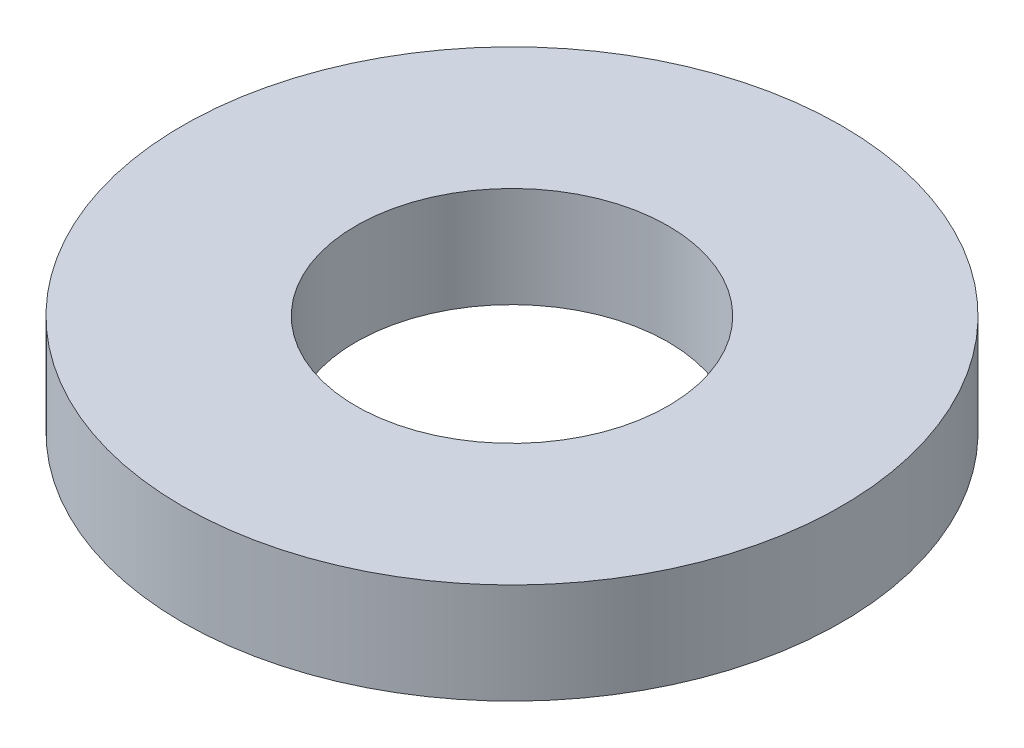
ISO-10303-21;
HEADER;
FILE_DESCRIPTION(('STEP AP214'),'2;1');
FILE_NAME('part.step','',(''),(''),'','','');
FILE_SCHEMA(('AUTOMOTIVE_DESIGN { 1 0 10303 214 1 1 1 1 }'));
ENDSEC;
DATA;
#1=APPLICATION_CONTEXT('core data for automotive mechanical design processes');
#2=APPLICATION_PROTOCOL_DEFINITION('international standard','automotive_design',2000,#1);
#3=PRODUCT_CONTEXT('',#1,'mechanical');
#4=PRODUCT('Part','Part','',(#3));
#5=PRODUCT_RELATED_PRODUCT_CATEGORY('part','',(#4));
#6=PRODUCT_DEFINITION_FORMATION('','',#4);
#7=PRODUCT_DEFINITION_CONTEXT('part definition',#1,'design');
#8=PRODUCT_DEFINITION('design','',#6,#7);
#9=PRODUCT_DEFINITION_SHAPE('','',#8);
#10=(LENGTH_UNIT() NAMED_UNIT(*) SI_UNIT(.MILLI.,.METRE.));
#11=(NAMED_UNIT(*) PLANE_ANGLE_UNIT() SI_UNIT($,.RADIAN.));
#12=(NAMED_UNIT(*) SI_UNIT($,.STERADIAN.) SOLID_ANGLE_UNIT());
#13=UNCERTAINTY_MEASURE_WITH_UNIT(LENGTH_MEASURE(1.E-05),#10,'distance_accuracy_value','');
#14=(GEOMETRIC_REPRESENTATION_CONTEXT(3) GLOBAL_UNCERTAINTY_ASSIGNED_CONTEXT((#13)) GLOBAL_UNIT_ASSIGNED_CONTEXT((#10,
#11,#12)) REPRESENTATION_CONTEXT('',''));
#15=CARTESIAN_POINT('',(0.,0.,0.));
#16=DIRECTION('',(0.,0.,1.));
#17=DIRECTION('',(1.,0.,0.));
#18=AXIS2_PLACEMENT_3D('',#15,#16,#17);
#19=CARTESIAN_POINT('',(0.,29.,0.));
#20=DIRECTION('',(0.,-1.,0.));
#21=DIRECTION('',(0.,0.,-1.));
#22=AXIS2_PLACEMENT_3D('',#19,#20,#21);
#23=CYLINDRICAL_SURFACE('',#22,95.);
#24=CARTESIAN_POINT('',(0.,29.,0.));
#25=DIRECTION('',(0.,1.,0.));
#26=DIRECTION('',(0.,0.,1.));
#27=AXIS2_PLACEMENT_3D('',#24,#25,#26);
#28=CIRCLE('',#27,95.);
#29=CARTESIAN_POINT('',(0.,29.,-95.));
#30=VERTEX_POINT('',#29);
#31=EDGE_CURVE('E10',#30,#30,#28,.T.);
#32=CARTESIAN_POINT('',(0.,0.,0.));
#33=DIRECTION('',(0.,1.,0.));
#34=DIRECTION('',(0.,0.,1.));
#35=AXIS2_PLACEMENT_3D('',#32,#33,#34);
#36=CIRCLE('',#35,95.);
#37=CARTESIAN_POINT('',(0.,0.,-95.));
#38=VERTEX_POINT('',#37);
#39=EDGE_CURVE('E37',#38,#38,#36,.T.);
#40=CARTESIAN_POINT('',(0.,29.,-95.));
#41=CARTESIAN_POINT('',(0.,28.6979166666667,-95.));
#42=CARTESIAN_POINT('',(0.,28.3958333333333,-95.));
#43=CARTESIAN_POINT('',(0.,27.7916666666667,-95.));
#44=CARTESIAN_POINT('',(0.,27.4895833333333,-95.));
#45=CARTESIAN_POINT('',(0.,26.8854166666667,-95.));
#46=CARTESIAN_POINT('',(0.,26.5833333333333,-95.));
#47=CARTESIAN_POINT('',(0.,25.9791666666667,-95.));
#48=CARTESIAN_POINT('',(0.,25.6770833333333,-95.));
#49=CARTESIAN_POINT('',(0.,25.0729166666667,-95.));
#50=CARTESIAN_POINT('',(0.,24.7708333333333,-95.));
#51=CARTESIAN_POINT('',(0.,24.1666666666667,-95.));
#52=CARTESIAN_POINT('',(0.,23.8645833333333,-95.));
#53=CARTESIAN_POINT('',(0.,23.2604166666667,-95.));
#54=CARTESIAN_POINT('',(0.,22.9583333333333,-95.));
#55=CARTESIAN_POINT('',(0.,22.3541666666667,-95.));
#56=CARTESIAN_POINT('',(0.,22.0520833333333,-95.));
#57=CARTESIAN_POINT('',(0.,21.4479166666667,-95.));
#58=CARTESIAN_POINT('',(0.,21.1458333333333,-95.));
#59=CARTESIAN_POINT('',(0.,20.5416666666667,-95.));
#60=CARTESIAN_POINT('',(0.,20.2395833333333,-95.));
#61=CARTESIAN_POINT('',(0.,19.6354166666667,-95.));
#62=CARTESIAN_POINT('',(0.,19.3333333333333,-95.));
#63=CARTESIAN_POINT('',(0.,18.7291666666667,-95.));
#64=CARTESIAN_POINT('',(0.,18.4270833333333,-95.));
#65=CARTESIAN_POINT('',(0.,17.8229166666667,-95.));
#66=CARTESIAN_POINT('',(0.,17.5208333333333,-95.));
#67=CARTESIAN_POINT('',(0.,16.9166666666667,-95.));
#68=CARTESIAN_POINT('',(0.,16.6145833333333,-95.));
#69=CARTESIAN_POINT('',(0.,16.0104166666667,-95.));
#70=CARTESIAN_POINT('',(0.,15.7083333333333,-95.));
#71=CARTESIAN_POINT('',(0.,15.1041666666667,-95.));
#72=CARTESIAN_POINT('',(0.,14.8020833333333,-95.));
#73=CARTESIAN_POINT('',(0.,14.1979166666667,-95.));
#74=CARTESIAN_POINT('',(0.,13.8958333333333,-95.));
#75=CARTESIAN_POINT('',(0.,13.2916666666667,-95.));
#76=CARTESIAN_POINT('',(0.,12.9895833333333,-95.));
#77=CARTESIAN_POINT('',(0.,12.3854166666667,-95.));
#78=CARTESIAN_POINT('',(0.,12.0833333333333,-95.));
#79=CARTESIAN_POINT('',(0.,11.4791666666667,-95.));
#80=CARTESIAN_POINT('',(0.,11.1770833333333,-95.));
#81=CARTESIAN_POINT('',(0.,10.5729166666667,-95.));
#82=CARTESIAN_POINT('',(0.,10.2708333333333,-95.));
#83=CARTESIAN_POINT('',(0.,9.66666666666667,-95.));
#84=CARTESIAN_POINT('',(0.,9.36458333333333,-95.));
#85=CARTESIAN_POINT('',(0.,8.76041666666667,-95.));
#86=CARTESIAN_POINT('',(0.,8.45833333333333,-95.));
#87=CARTESIAN_POINT('',(0.,7.85416666666667,-95.));
#88=CARTESIAN_POINT('',(0.,7.55208333333333,-95.));
#89=CARTESIAN_POINT('',(0.,6.94791666666667,-95.));
#90=CARTESIAN_POINT('',(0.,6.64583333333333,-95.));
#91=CARTESIAN_POINT('',(0.,6.04166666666667,-95.));
#92=CARTESIAN_POINT('',(0.,5.73958333333333,-95.));
#93=CARTESIAN_POINT('',(0.,5.13541666666667,-95.));
#94=CARTESIAN_POINT('',(0.,4.83333333333333,-95.));
#95=CARTESIAN_POINT('',(0.,4.22916666666667,-95.));
#96=CARTESIAN_POINT('',(0.,3.92708333333333,-95.));
#97=CARTESIAN_POINT('',(0.,3.32291666666667,-95.));
#98=CARTESIAN_POINT('',(0.,3.02083333333333,-95.));
#99=CARTESIAN_POINT('',(0.,2.41666666666667,-95.));
#100=CARTESIAN_POINT('',(0.,2.11458333333333,-95.));
#101=CARTESIAN_POINT('',(0.,1.51041666666667,-95.));
#102=CARTESIAN_POINT('',(0.,1.20833333333333,-95.));
#103=CARTESIAN_POINT('',(0.,0.604166666666667,-95.));
#104=CARTESIAN_POINT('',(0.,0.302083333333333,-95.));
#105=CARTESIAN_POINT('',(0.,0.,-95.));
#106=B_SPLINE_CURVE_WITH_KNOTS('',3,(#40,#41,#42,#43,#44,#45,#46,#47,#48,#49,#50,#51,#52,#53,
#54,#55,#56,#57,#58,#59,#60,#61,#62,#63,#64,#65,#66,#67,#68,#69,#70,#71,#72,#73,#74,#75,#76,#77,
#78,#79,#80,#81,#82,#83,#84,#85,#86,#87,#88,#89,#90,#91,#92,#93,#94,#95,#96,#97,#98,#99,#100,
#101,#102,#103,#104,#105),.UNSPECIFIED.,.F.,.F.,(4,2,2,2,2,2,2,2,2,2,2,2,2,2,2,2,2,2,2,2,2,2,2,
2,2,2,2,2,2,2,2,2,4),(0.,0.906249999999997,1.8125,2.71875,3.625,4.53125,5.4375,6.34375,7.25,
8.15625,9.0625,9.96875,10.875,11.78125,12.6875,13.59375,14.5,15.40625,16.3125,17.21875,18.125,
19.03125,19.9375,20.84375,21.75,22.65625,23.5625,24.46875,25.375,26.28125,27.1875,28.09375,29.),.UNSPECIFIED.);
#107=EDGE_CURVE('BSEAM40',#30,#38,#106,.T.);
#108=ORIENTED_EDGE('',*,*,#31,.F.);
#109=ORIENTED_EDGE('',*,*,#39,.T.);
#110=ORIENTED_EDGE('',*,*,#107,.T.);
#111=ORIENTED_EDGE('',*,*,#107,.F.);
#112=EDGE_LOOP('',(#108,#110,#109,#111));
#113=FACE_BOUND('',#112,.T.);
#114=ADVANCED_FACE('F40',(#113),#23,.T.);
#115=CARTESIAN_POINT('',(0.,29.,0.));
#116=DIRECTION('',(0.,1.,0.));
#117=DIRECTION('',(0.,0.,1.));
#118=AXIS2_PLACEMENT_3D('',#115,#116,#117);
#119=PLANE('',#118);
#120=CARTESIAN_POINT('',(0.,29.,0.));
#121=DIRECTION('',(0.,1.,0.));
#122=DIRECTION('',(0.,0.,1.));
#123=AXIS2_PLACEMENT_3D('',#120,#121,#122);
#124=CIRCLE('',#123,45.);
#125=CARTESIAN_POINT('',(0.,29.,-45.));
#126=VERTEX_POINT('',#125);
#127=EDGE_CURVE('E50',#126,#126,#124,.T.);
#128=ORIENTED_EDGE('',*,*,#127,.F.);
#129=EDGE_LOOP('',(#128));
#130=FACE_BOUND('',#129,.T.);
#131=ORIENTED_EDGE('',*,*,#31,.T.);
#132=EDGE_LOOP('',(#131));
#133=FACE_BOUND('',#132,.T.);
#134=ADVANCED_FACE('F59',(#130,#133),#119,.T.);
#135=CARTESIAN_POINT('',(0.,0.,0.));
#136=DIRECTION('',(0.,1.,0.));
#137=DIRECTION('',(0.,0.,1.));
#138=AXIS2_PLACEMENT_3D('',#135,#136,#137);
#139=PLANE('',#138);
#140=CARTESIAN_POINT('',(0.,0.,0.));
#141=DIRECTION('',(0.,1.,0.));
#142=DIRECTION('',(0.,0.,1.));
#143=AXIS2_PLACEMENT_3D('',#140,#141,#142);
#144=CIRCLE('',#143,45.);
#145=CARTESIAN_POINT('',(0.,0.,-45.));
#146=VERTEX_POINT('',#145);
#147=EDGE_CURVE('E47',#146,#146,#144,.T.);
#148=ORIENTED_EDGE('',*,*,#147,.T.);
#149=EDGE_LOOP('',(#148));
#150=FACE_BOUND('',#149,.T.);
#151=ORIENTED_EDGE('',*,*,#39,.F.);
#152=EDGE_LOOP('',(#151));
#153=FACE_BOUND('',#152,.T.);
#154=ADVANCED_FACE('F58',(#150,#153),#139,.F.);
#155=CARTESIAN_POINT('',(0.,29.,0.));
#156=DIRECTION('',(0.,-1.,0.));
#157=DIRECTION('',(0.,0.,-1.));
#158=AXIS2_PLACEMENT_3D('',#155,#156,#157);
#159=CYLINDRICAL_SURFACE('',#158,45.);
#160=CARTESIAN_POINT('',(0.,29.,-45.));
#161=CARTESIAN_POINT('',(0.,28.6979166666667,-45.));
#162=CARTESIAN_POINT('',(0.,28.3958333333333,-45.));
#163=CARTESIAN_POINT('',(0.,27.7916666666667,-45.));
#164=CARTESIAN_POINT('',(0.,27.4895833333333,-45.));
#165=CARTESIAN_POINT('',(0.,26.8854166666667,-45.));
#166=CARTESIAN_POINT('',(0.,26.5833333333333,-45.));
#167=CARTESIAN_POINT('',(0.,25.9791666666667,-45.));
#168=CARTESIAN_POINT('',(0.,25.6770833333333,-45.));
#169=CARTESIAN_POINT('',(0.,25.0729166666667,-45.));
#170=CARTESIAN_POINT('',(0.,24.7708333333333,-45.));
#171=CARTESIAN_POINT('',(0.,24.1666666666667,-45.));
#172=CARTESIAN_POINT('',(0.,23.8645833333333,-45.));
#173=CARTESIAN_POINT('',(0.,23.2604166666667,-45.));
#174=CARTESIAN_POINT('',(0.,22.9583333333333,-45.));
#175=CARTESIAN_POINT('',(0.,22.3541666666667,-45.));
#176=CARTESIAN_POINT('',(0.,22.0520833333333,-45.));
#177=CARTESIAN_POINT('',(0.,21.4479166666667,-45.));
#178=CARTESIAN_POINT('',(0.,21.1458333333333,-45.));
#179=CARTESIAN_POINT('',(0.,20.5416666666667,-45.));
#180=CARTESIAN_POINT('',(0.,20.2395833333333,-45.));
#181=CARTESIAN_POINT('',(0.,19.6354166666667,-45.));
#182=CARTESIAN_POINT('',(0.,19.3333333333333,-45.));
#183=CARTESIAN_POINT('',(0.,18.7291666666667,-45.));
#184=CARTESIAN_POINT('',(0.,18.4270833333333,-45.));
#185=CARTESIAN_POINT('',(0.,17.8229166666667,-45.));
#186=CARTESIAN_POINT('',(0.,17.5208333333333,-45.));
#187=CARTESIAN_POINT('',(0.,16.9166666666667,-45.));
#188=CARTESIAN_POINT('',(0.,16.6145833333333,-45.));
#189=CARTESIAN_POINT('',(0.,16.0104166666667,-45.));
#190=CARTESIAN_POINT('',(0.,15.7083333333333,-45.));
#191=CARTESIAN_POINT('',(0.,15.1041666666667,-45.));
#192=CARTESIAN_POINT('',(0.,14.8020833333333,-45.));
#193=CARTESIAN_POINT('',(0.,14.1979166666667,-45.));
#194=CARTESIAN_POINT('',(0.,13.8958333333333,-45.));
#195=CARTESIAN_POINT('',(0.,13.2916666666667,-45.));
#196=CARTESIAN_POINT('',(0.,12.9895833333333,-45.));
#197=CARTESIAN_POINT('',(0.,12.3854166666667,-45.));
#198=CARTESIAN_POINT('',(0.,12.0833333333333,-45.));
#199=CARTESIAN_POINT('',(0.,11.4791666666667,-45.));
#200=CARTESIAN_POINT('',(0.,11.1770833333333,-45.));
#201=CARTESIAN_POINT('',(0.,10.5729166666667,-45.));
#202=CARTESIAN_POINT('',(0.,10.2708333333333,-45.));
#203=CARTESIAN_POINT('',(0.,9.66666666666667,-45.));
#204=CARTESIAN_POINT('',(0.,9.36458333333333,-45.));
#205=CARTESIAN_POINT('',(0.,8.76041666666667,-45.));
#206=CARTESIAN_POINT('',(0.,8.45833333333333,-45.));
#207=CARTESIAN_POINT('',(0.,7.85416666666667,-45.));
#208=CARTESIAN_POINT('',(0.,7.55208333333333,-45.));
#209=CARTESIAN_POINT('',(0.,6.94791666666667,-45.));
#210=CARTESIAN_POINT('',(0.,6.64583333333333,-45.));
#211=CARTESIAN_POINT('',(0.,6.04166666666667,-45.));
#212=CARTESIAN_POINT('',(0.,5.73958333333333,-45.));
#213=CARTESIAN_POINT('',(0.,5.13541666666667,-45.));
#214=CARTESIAN_POINT('',(0.,4.83333333333333,-45.));
#215=CARTESIAN_POINT('',(0.,4.22916666666667,-45.));
#216=CARTESIAN_POINT('',(0.,3.92708333333333,-45.));
#217=CARTESIAN_POINT('',(0.,3.32291666666667,-45.));
#218=CARTESIAN_POINT('',(0.,3.02083333333333,-45.));
#219=CARTESIAN_POINT('',(0.,2.41666666666667,-45.));
#220=CARTESIAN_POINT('',(0.,2.11458333333333,-45.));
#221=CARTESIAN_POINT('',(0.,1.51041666666667,-45.));
#222=CARTESIAN_POINT('',(0.,1.20833333333333,-45.));
#223=CARTESIAN_POINT('',(0.,0.604166666666667,-45.));
#224=CARTESIAN_POINT('',(0.,0.302083333333333,-45.));
#225=CARTESIAN_POINT('',(0.,0.,-45.));
#226=B_SPLINE_CURVE_WITH_KNOTS('',3,(#160,#161,#162,#163,#164,#165,#166,#167,#168,#169,#170,
#171,#172,#173,#174,#175,#176,#177,#178,#179,#180,#181,#182,#183,#184,#185,#186,#187,#188,#189,
#190,#191,#192,#193,#194,#195,#196,#197,#198,#199,#200,#201,#202,#203,#204,#205,#206,#207,#208,
#209,#210,#211,#212,#213,#214,#215,#216,#217,#218,#219,#220,#221,#222,#223,#224,#225),
.UNSPECIFIED.,.F.,.F.,(4,2,2,2,2,2,2,2,2,2,2,2,2,2,2,2,2,2,2,2,2,2,2,2,2,2,2,2,2,2,2,2,4),(0.,
0.906249999999997,1.8125,2.71875,3.625,4.53125,5.4375,6.34375,7.25,8.15625,9.0625,9.96875,
10.875,11.78125,12.6875,13.59375,14.5,15.40625,16.3125,17.21875,18.125,19.03125,19.9375,
20.84375,21.75,22.65625,23.5625,24.46875,25.375,26.28125,27.1875,28.09375,29.),.UNSPECIFIED.);
#227=EDGE_CURVE('BSEAM54',#126,#146,#226,.T.);
#228=ORIENTED_EDGE('',*,*,#127,.T.);
#229=ORIENTED_EDGE('',*,*,#147,.F.);
#230=ORIENTED_EDGE('',*,*,#227,.T.);
#231=ORIENTED_EDGE('',*,*,#227,.F.);
#232=EDGE_LOOP('',(#228,#230,#229,#231));
#233=FACE_BOUND('',#232,.T.);
#234=ADVANCED_FACE('F54',(#233),#159,.F.);
#235=CLOSED_SHELL('',(#114,#134,#154,#234));
#236=MANIFOLD_SOLID_BREP('B2',#235);
#237=ADVANCED_BREP_SHAPE_REPRESENTATION('',(#18,#236),#14);
#238=SHAPE_DEFINITION_REPRESENTATION(#9,#237);
ENDSEC;
END-ISO-10303-21;
